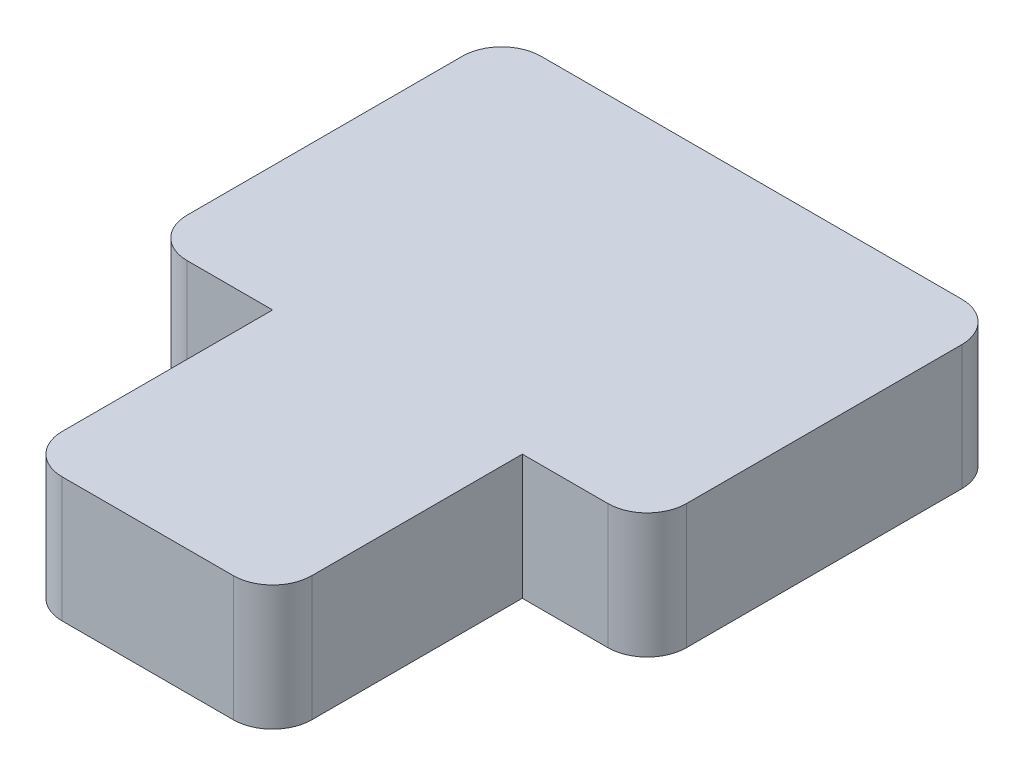
ISO-10303-21;
HEADER;
FILE_DESCRIPTION(('STEP AP214'),'2;1');
FILE_NAME('part.step','',(''),(''),'','','');
FILE_SCHEMA(('AUTOMOTIVE_DESIGN { 1 0 10303 214 1 1 1 1 }'));
ENDSEC;
DATA;
#1=APPLICATION_CONTEXT('core data for automotive mechanical design processes');
#2=APPLICATION_PROTOCOL_DEFINITION('international standard','automotive_design',2000,#1);
#3=PRODUCT_CONTEXT('',#1,'mechanical');
#4=PRODUCT('Part','Part','',(#3));
#5=PRODUCT_RELATED_PRODUCT_CATEGORY('part','',(#4));
#6=PRODUCT_DEFINITION_FORMATION('','',#4);
#7=PRODUCT_DEFINITION_CONTEXT('part definition',#1,'design');
#8=PRODUCT_DEFINITION('design','',#6,#7);
#9=PRODUCT_DEFINITION_SHAPE('','',#8);
#10=(LENGTH_UNIT() NAMED_UNIT(*) SI_UNIT(.MILLI.,.METRE.));
#11=(NAMED_UNIT(*) PLANE_ANGLE_UNIT() SI_UNIT($,.RADIAN.));
#12=(NAMED_UNIT(*) SI_UNIT($,.STERADIAN.) SOLID_ANGLE_UNIT());
#13=UNCERTAINTY_MEASURE_WITH_UNIT(LENGTH_MEASURE(1.E-05),#10,'distance_accuracy_value','');
#14=(GEOMETRIC_REPRESENTATION_CONTEXT(3) GLOBAL_UNCERTAINTY_ASSIGNED_CONTEXT((#13)) GLOBAL_UNIT_ASSIGNED_CONTEXT((#10,
#11,#12)) REPRESENTATION_CONTEXT('',''));
#15=CARTESIAN_POINT('',(0.,0.,0.));
#16=DIRECTION('',(0.,0.,1.));
#17=DIRECTION('',(1.,0.,0.));
#18=AXIS2_PLACEMENT_3D('',#15,#16,#17);
#19=CARTESIAN_POINT('',(0.,3.175,0.));
#20=DIRECTION('',(1.,0.,0.));
#21=DIRECTION('',(0.,0.,-1.));
#22=AXIS2_PLACEMENT_3D('',#19,#20,#21);
#23=PLANE('',#22);
#24=DIRECTION('',(0.,0.,1.));
#25=VECTOR('',#24,1.);
#26=CARTESIAN_POINT('',(0.,0.,0.));
#27=LINE('',#26,#25);
#28=CARTESIAN_POINT('',(0.,0.,-6.35));
#29=VERTEX_POINT('',#28);
#30=CARTESIAN_POINT('',(0.,0.,-1.));
#31=VERTEX_POINT('',#30);
#32=EDGE_CURVE('E175',#29,#31,#27,.T.);
#33=ORIENTED_EDGE('',*,*,#32,.T.);
#34=DIRECTION('',(0.,-1.,0.));
#35=VECTOR('',#34,1.);
#36=CARTESIAN_POINT('',(0.,3.175,-1.));
#37=LINE('',#36,#35);
#38=CARTESIAN_POINT('',(0.,3.175,-1.));
#39=VERTEX_POINT('',#38);
#40=EDGE_CURVE('E41',#31,#39,#37,.F.);
#41=ORIENTED_EDGE('',*,*,#40,.T.);
#42=DIRECTION('',(0.,0.,1.));
#43=VECTOR('',#42,1.);
#44=CARTESIAN_POINT('',(0.,3.175,0.));
#45=LINE('',#44,#43);
#46=CARTESIAN_POINT('',(0.,3.175,-6.35));
#47=VERTEX_POINT('',#46);
#48=EDGE_CURVE('E194',#47,#39,#45,.T.);
#49=ORIENTED_EDGE('',*,*,#48,.F.);
#50=DIRECTION('',(0.,-1.,0.));
#51=VECTOR('',#50,1.);
#52=CARTESIAN_POINT('',(0.,3.175,-6.35));
#53=LINE('',#52,#51);
#54=EDGE_CURVE('E159',#47,#29,#53,.T.);
#55=ORIENTED_EDGE('',*,*,#54,.T.);
#56=EDGE_LOOP('',(#33,#41,#49,#55));
#57=FACE_BOUND('',#56,.T.);
#58=ADVANCED_FACE('F33',(#57),#23,.F.);
#59=CARTESIAN_POINT('',(0.,3.175,0.));
#60=DIRECTION('',(0.,0.,-1.));
#61=DIRECTION('',(-1.,0.,0.));
#62=AXIS2_PLACEMENT_3D('',#59,#60,#61);
#63=PLANE('',#62);
#64=DIRECTION('',(1.,0.,0.));
#65=VECTOR('',#64,1.);
#66=CARTESIAN_POINT('',(0.,3.175,0.));
#67=LINE('',#66,#65);
#68=CARTESIAN_POINT('',(0.999999999999999,3.175,0.));
#69=VERTEX_POINT('',#68);
#70=CARTESIAN_POINT('',(5.35,3.175,0.));
#71=VERTEX_POINT('',#70);
#72=EDGE_CURVE('E148',#69,#71,#67,.T.);
#73=ORIENTED_EDGE('',*,*,#72,.F.);
#74=DIRECTION('',(0.,-1.,0.));
#75=VECTOR('',#74,1.);
#76=CARTESIAN_POINT('',(1.,3.175,0.));
#77=LINE('',#76,#75);
#78=CARTESIAN_POINT('',(0.999999999999999,0.,0.));
#79=VERTEX_POINT('',#78);
#80=EDGE_CURVE('E238',#69,#79,#77,.T.);
#81=ORIENTED_EDGE('',*,*,#80,.T.);
#82=DIRECTION('',(1.,0.,0.));
#83=VECTOR('',#82,1.);
#84=CARTESIAN_POINT('',(0.,0.,0.));
#85=LINE('',#84,#83);
#86=CARTESIAN_POINT('',(5.35,0.,0.));
#87=VERTEX_POINT('',#86);
#88=EDGE_CURVE('E178',#79,#87,#85,.T.);
#89=ORIENTED_EDGE('',*,*,#88,.T.);
#90=DIRECTION('',(0.,-1.,0.));
#91=VECTOR('',#90,1.);
#92=CARTESIAN_POINT('',(5.35,3.175,0.));
#93=LINE('',#92,#91);
#94=EDGE_CURVE('E236',#87,#71,#93,.F.);
#95=ORIENTED_EDGE('',*,*,#94,.T.);
#96=EDGE_LOOP('',(#73,#81,#89,#95));
#97=FACE_BOUND('',#96,.T.);
#98=ADVANCED_FACE('F254',(#97),#63,.F.);
#99=CARTESIAN_POINT('',(6.35,3.175,0.));
#100=DIRECTION('',(-1.,0.,0.));
#101=DIRECTION('',(0.,0.,1.));
#102=AXIS2_PLACEMENT_3D('',#99,#100,#101);
#103=PLANE('',#102);
#104=DIRECTION('',(0.,0.,-1.));
#105=VECTOR('',#104,1.);
#106=CARTESIAN_POINT('',(6.35,3.175,0.));
#107=LINE('',#106,#105);
#108=CARTESIAN_POINT('',(6.35,3.175,-1.));
#109=VERTEX_POINT('',#108);
#110=CARTESIAN_POINT('',(6.35,3.175,-6.35));
#111=VERTEX_POINT('',#110);
#112=EDGE_CURVE('E136',#109,#111,#107,.T.);
#113=ORIENTED_EDGE('',*,*,#112,.F.);
#114=DIRECTION('',(0.,-1.,0.));
#115=VECTOR('',#114,1.);
#116=CARTESIAN_POINT('',(6.35,3.175,-1.));
#117=LINE('',#116,#115);
#118=CARTESIAN_POINT('',(6.35,0.,-1.));
#119=VERTEX_POINT('',#118);
#120=EDGE_CURVE('E11',#109,#119,#117,.T.);
#121=ORIENTED_EDGE('',*,*,#120,.T.);
#122=DIRECTION('',(0.,0.,-1.));
#123=VECTOR('',#122,1.);
#124=CARTESIAN_POINT('',(6.35,0.,0.));
#125=LINE('',#124,#123);
#126=CARTESIAN_POINT('',(6.35,0.,-6.35));
#127=VERTEX_POINT('',#126);
#128=EDGE_CURVE('E154',#119,#127,#125,.T.);
#129=ORIENTED_EDGE('',*,*,#128,.T.);
#130=DIRECTION('',(0.,-1.,0.));
#131=VECTOR('',#130,1.);
#132=CARTESIAN_POINT('',(6.35,3.175,-6.35));
#133=LINE('',#132,#131);
#134=EDGE_CURVE('E151',#111,#127,#133,.T.);
#135=ORIENTED_EDGE('',*,*,#134,.F.);
#136=EDGE_LOOP('',(#113,#121,#129,#135));
#137=FACE_BOUND('',#136,.T.);
#138=ADVANCED_FACE('F152',(#137),#103,.F.);
#139=CARTESIAN_POINT('',(6.35,3.175,-6.35));
#140=DIRECTION('',(0.,0.,-1.));
#141=DIRECTION('',(-1.,0.,0.));
#142=AXIS2_PLACEMENT_3D('',#139,#140,#141);
#143=PLANE('',#142);
#144=DIRECTION('',(1.,0.,0.));
#145=VECTOR('',#144,1.);
#146=CARTESIAN_POINT('',(6.35,0.,-6.35));
#147=LINE('',#146,#145);
#148=CARTESIAN_POINT('',(8.525,0.,-6.35));
#149=VERTEX_POINT('',#148);
#150=EDGE_CURVE('E182',#127,#149,#147,.T.);
#151=ORIENTED_EDGE('',*,*,#150,.T.);
#152=DIRECTION('',(0.,-1.,0.));
#153=VECTOR('',#152,1.);
#154=CARTESIAN_POINT('',(8.525,3.175,-6.35));
#155=LINE('',#154,#153);
#156=CARTESIAN_POINT('',(8.525,3.175,-6.35));
#157=VERTEX_POINT('',#156);
#158=EDGE_CURVE('E163',#149,#157,#155,.F.);
#159=ORIENTED_EDGE('',*,*,#158,.T.);
#160=DIRECTION('',(1.,0.,0.));
#161=VECTOR('',#160,1.);
#162=CARTESIAN_POINT('',(6.35,3.175,-6.35));
#163=LINE('',#162,#161);
#164=EDGE_CURVE('E141',#111,#157,#163,.T.);
#165=ORIENTED_EDGE('',*,*,#164,.F.);
#166=ORIENTED_EDGE('',*,*,#134,.T.);
#167=EDGE_LOOP('',(#151,#159,#165,#166));
#168=FACE_BOUND('',#167,.T.);
#169=ADVANCED_FACE('F161',(#168),#143,.F.);
#170=CARTESIAN_POINT('',(9.525,3.175,-15.35));
#171=DIRECTION('',(-1.,0.,0.));
#172=DIRECTION('',(0.,0.,1.));
#173=AXIS2_PLACEMENT_3D('',#170,#171,#172);
#174=PLANE('',#173);
#175=DIRECTION('',(0.,0.,-1.));
#176=VECTOR('',#175,1.);
#177=CARTESIAN_POINT('',(9.525,3.175,-15.35));
#178=LINE('',#177,#176);
#179=CARTESIAN_POINT('',(9.525,3.175,-7.35));
#180=VERTEX_POINT('',#179);
#181=CARTESIAN_POINT('',(9.525,3.175,-14.35));
#182=VERTEX_POINT('',#181);
#183=EDGE_CURVE('E164',#180,#182,#178,.T.);
#184=ORIENTED_EDGE('',*,*,#183,.F.);
#185=DIRECTION('',(0.,-1.,0.));
#186=VECTOR('',#185,1.);
#187=CARTESIAN_POINT('',(9.525,3.175,-7.35));
#188=LINE('',#187,#186);
#189=CARTESIAN_POINT('',(9.525,0.,-7.35));
#190=VERTEX_POINT('',#189);
#191=EDGE_CURVE('E232',#180,#190,#188,.T.);
#192=ORIENTED_EDGE('',*,*,#191,.T.);
#193=DIRECTION('',(0.,0.,-1.));
#194=VECTOR('',#193,1.);
#195=CARTESIAN_POINT('',(9.525,0.,-15.35));
#196=LINE('',#195,#194);
#197=CARTESIAN_POINT('',(9.525,0.,-14.35));
#198=VERTEX_POINT('',#197);
#199=EDGE_CURVE('E184',#190,#198,#196,.T.);
#200=ORIENTED_EDGE('',*,*,#199,.T.);
#201=DIRECTION('',(0.,-1.,0.));
#202=VECTOR('',#201,1.);
#203=CARTESIAN_POINT('',(9.525,3.175,-14.35));
#204=LINE('',#203,#202);
#205=EDGE_CURVE('E56',#198,#182,#204,.F.);
#206=ORIENTED_EDGE('',*,*,#205,.T.);
#207=EDGE_LOOP('',(#184,#192,#200,#206));
#208=FACE_BOUND('',#207,.T.);
#209=ADVANCED_FACE('F307',(#208),#174,.F.);
#210=CARTESIAN_POINT('',(-3.175,3.175,-15.35));
#211=DIRECTION('',(0.,0.,1.));
#212=DIRECTION('',(1.,0.,0.));
#213=AXIS2_PLACEMENT_3D('',#210,#211,#212);
#214=PLANE('',#213);
#215=DIRECTION('',(-1.,0.,0.));
#216=VECTOR('',#215,1.);
#217=CARTESIAN_POINT('',(-3.175,0.,-15.35));
#218=LINE('',#217,#216);
#219=CARTESIAN_POINT('',(8.525,0.,-15.35));
#220=VERTEX_POINT('',#219);
#221=CARTESIAN_POINT('',(-2.175,0.,-15.35));
#222=VERTEX_POINT('',#221);
#223=EDGE_CURVE('E186',#220,#222,#218,.T.);
#224=ORIENTED_EDGE('',*,*,#223,.T.);
#225=DIRECTION('',(0.,-1.,0.));
#226=VECTOR('',#225,1.);
#227=CARTESIAN_POINT('',(-2.175,3.175,-15.35));
#228=LINE('',#227,#226);
#229=CARTESIAN_POINT('',(-2.175,3.175,-15.35));
#230=VERTEX_POINT('',#229);
#231=EDGE_CURVE('E216',#222,#230,#228,.F.);
#232=ORIENTED_EDGE('',*,*,#231,.T.);
#233=DIRECTION('',(-1.,0.,0.));
#234=VECTOR('',#233,1.);
#235=CARTESIAN_POINT('',(-3.175,3.175,-15.35));
#236=LINE('',#235,#234);
#237=CARTESIAN_POINT('',(8.525,3.175,-15.35));
#238=VERTEX_POINT('',#237);
#239=EDGE_CURVE('E166',#238,#230,#236,.T.);
#240=ORIENTED_EDGE('',*,*,#239,.F.);
#241=DIRECTION('',(0.,-1.,0.));
#242=VECTOR('',#241,1.);
#243=CARTESIAN_POINT('',(8.525,3.175,-15.35));
#244=LINE('',#243,#242);
#245=EDGE_CURVE('E213',#238,#220,#244,.T.);
#246=ORIENTED_EDGE('',*,*,#245,.T.);
#247=EDGE_LOOP('',(#224,#232,#240,#246));
#248=FACE_BOUND('',#247,.T.);
#249=ADVANCED_FACE('F294',(#248),#214,.F.);
#250=CARTESIAN_POINT('',(-3.175,3.175,-15.35));
#251=DIRECTION('',(1.,0.,0.));
#252=DIRECTION('',(0.,0.,-1.));
#253=AXIS2_PLACEMENT_3D('',#250,#251,#252);
#254=PLANE('',#253);
#255=DIRECTION('',(0.,0.,1.));
#256=VECTOR('',#255,1.);
#257=CARTESIAN_POINT('',(-3.175,3.175,-15.35));
#258=LINE('',#257,#256);
#259=CARTESIAN_POINT('',(-3.175,3.175,-14.35));
#260=VERTEX_POINT('',#259);
#261=CARTESIAN_POINT('',(-3.175,3.175,-7.35));
#262=VERTEX_POINT('',#261);
#263=EDGE_CURVE('E171',#260,#262,#258,.T.);
#264=ORIENTED_EDGE('',*,*,#263,.F.);
#265=DIRECTION('',(0.,-1.,0.));
#266=VECTOR('',#265,1.);
#267=CARTESIAN_POINT('',(-3.175,3.175,-14.35));
#268=LINE('',#267,#266);
#269=CARTESIAN_POINT('',(-3.175,0.,-14.35));
#270=VERTEX_POINT('',#269);
#271=EDGE_CURVE('E198',#260,#270,#268,.T.);
#272=ORIENTED_EDGE('',*,*,#271,.T.);
#273=DIRECTION('',(0.,0.,1.));
#274=VECTOR('',#273,1.);
#275=CARTESIAN_POINT('',(-3.175,0.,-15.35));
#276=LINE('',#275,#274);
#277=CARTESIAN_POINT('',(-3.175,0.,-7.35));
#278=VERTEX_POINT('',#277);
#279=EDGE_CURVE('E189',#270,#278,#276,.T.);
#280=ORIENTED_EDGE('',*,*,#279,.T.);
#281=DIRECTION('',(0.,-1.,0.));
#282=VECTOR('',#281,1.);
#283=CARTESIAN_POINT('',(-3.175,3.175,-7.35));
#284=LINE('',#283,#282);
#285=EDGE_CURVE('E158',#278,#262,#284,.F.);
#286=ORIENTED_EDGE('',*,*,#285,.T.);
#287=EDGE_LOOP('',(#264,#272,#280,#286));
#288=FACE_BOUND('',#287,.T.);
#289=ADVANCED_FACE('F300',(#288),#254,.F.);
#290=CARTESIAN_POINT('',(-3.175,3.175,-6.35));
#291=DIRECTION('',(0.,0.,-1.));
#292=DIRECTION('',(-1.,0.,0.));
#293=AXIS2_PLACEMENT_3D('',#290,#291,#292);
#294=PLANE('',#293);
#295=DIRECTION('',(1.,0.,0.));
#296=VECTOR('',#295,1.);
#297=CARTESIAN_POINT('',(-3.175,3.175,-6.35));
#298=LINE('',#297,#296);
#299=CARTESIAN_POINT('',(-2.175,3.175,-6.35));
#300=VERTEX_POINT('',#299);
#301=EDGE_CURVE('E173',#300,#47,#298,.T.);
#302=ORIENTED_EDGE('',*,*,#301,.F.);
#303=DIRECTION('',(0.,-1.,0.));
#304=VECTOR('',#303,1.);
#305=CARTESIAN_POINT('',(-2.175,3.175,-6.35));
#306=LINE('',#305,#304);
#307=CARTESIAN_POINT('',(-2.175,0.,-6.35));
#308=VERTEX_POINT('',#307);
#309=EDGE_CURVE('E228',#300,#308,#306,.T.);
#310=ORIENTED_EDGE('',*,*,#309,.T.);
#311=DIRECTION('',(1.,0.,0.));
#312=VECTOR('',#311,1.);
#313=CARTESIAN_POINT('',(-3.175,0.,-6.35));
#314=LINE('',#313,#312);
#315=EDGE_CURVE('E192',#308,#29,#314,.T.);
#316=ORIENTED_EDGE('',*,*,#315,.T.);
#317=ORIENTED_EDGE('',*,*,#54,.F.);
#318=EDGE_LOOP('',(#302,#310,#316,#317));
#319=FACE_BOUND('',#318,.T.);
#320=ADVANCED_FACE('F305',(#319),#294,.F.);
#321=CARTESIAN_POINT('',(0.,3.175,0.));
#322=DIRECTION('',(0.,-1.,0.));
#323=DIRECTION('',(0.,0.,-1.));
#324=AXIS2_PLACEMENT_3D('',#321,#322,#323);
#325=PLANE('',#324);
#326=ORIENTED_EDGE('',*,*,#239,.T.);
#327=CARTESIAN_POINT('',(-2.175,3.175,-14.35));
#328=DIRECTION('',(0.,-1.,0.));
#329=DIRECTION('',(0.,0.,-1.));
#330=AXIS2_PLACEMENT_3D('',#327,#328,#329);
#331=CIRCLE('',#330,1.);
#332=EDGE_CURVE('E226',#230,#260,#331,.F.);
#333=ORIENTED_EDGE('',*,*,#332,.T.);
#334=ORIENTED_EDGE('',*,*,#263,.T.);
#335=CARTESIAN_POINT('',(-2.175,3.175,-7.35));
#336=DIRECTION('',(0.,-1.,0.));
#337=DIRECTION('',(0.,0.,-1.));
#338=AXIS2_PLACEMENT_3D('',#335,#336,#337);
#339=CIRCLE('',#338,1.);
#340=EDGE_CURVE('E48',#262,#300,#339,.F.);
#341=ORIENTED_EDGE('',*,*,#340,.T.);
#342=ORIENTED_EDGE('',*,*,#301,.T.);
#343=ORIENTED_EDGE('',*,*,#48,.T.);
#344=CARTESIAN_POINT('',(1.,3.175,-1.));
#345=DIRECTION('',(0.,-1.,0.));
#346=DIRECTION('',(0.,0.,-1.));
#347=AXIS2_PLACEMENT_3D('',#344,#345,#346);
#348=CIRCLE('',#347,1.);
#349=EDGE_CURVE('E219',#39,#69,#348,.F.);
#350=ORIENTED_EDGE('',*,*,#349,.T.);
#351=ORIENTED_EDGE('',*,*,#72,.T.);
#352=CARTESIAN_POINT('',(5.35,3.175,-1.));
#353=DIRECTION('',(0.,-1.,0.));
#354=DIRECTION('',(0.,0.,-1.));
#355=AXIS2_PLACEMENT_3D('',#352,#353,#354);
#356=CIRCLE('',#355,1.);
#357=EDGE_CURVE('E145',#71,#109,#356,.F.);
#358=ORIENTED_EDGE('',*,*,#357,.T.);
#359=ORIENTED_EDGE('',*,*,#112,.T.);
#360=ORIENTED_EDGE('',*,*,#164,.T.);
#361=CARTESIAN_POINT('',(8.525,3.175,-7.35));
#362=DIRECTION('',(0.,-1.,0.));
#363=DIRECTION('',(0.,0.,-1.));
#364=AXIS2_PLACEMENT_3D('',#361,#362,#363);
#365=CIRCLE('',#364,1.);
#366=EDGE_CURVE('E223',#157,#180,#365,.F.);
#367=ORIENTED_EDGE('',*,*,#366,.T.);
#368=ORIENTED_EDGE('',*,*,#183,.T.);
#369=CARTESIAN_POINT('',(8.525,3.175,-14.35));
#370=DIRECTION('',(0.,-1.,0.));
#371=DIRECTION('',(0.,0.,-1.));
#372=AXIS2_PLACEMENT_3D('',#369,#370,#371);
#373=CIRCLE('',#372,1.);
#374=EDGE_CURVE('E221',#182,#238,#373,.F.);
#375=ORIENTED_EDGE('',*,*,#374,.T.);
#376=EDGE_LOOP('',(#326,#333,#334,#341,#342,#343,#350,#351,#358,#359,#360,#367,#368,#375));
#377=FACE_BOUND('',#376,.T.);
#378=ADVANCED_FACE('F139',(#377),#325,.F.);
#379=CARTESIAN_POINT('',(0.,0.,0.));
#380=DIRECTION('',(0.,-1.,0.));
#381=DIRECTION('',(0.,0.,-1.));
#382=AXIS2_PLACEMENT_3D('',#379,#380,#381);
#383=PLANE('',#382);
#384=ORIENTED_EDGE('',*,*,#279,.F.);
#385=CARTESIAN_POINT('',(-2.175,0.,-14.35));
#386=DIRECTION('',(0.,-1.,0.));
#387=DIRECTION('',(0.,0.,-1.));
#388=AXIS2_PLACEMENT_3D('',#385,#386,#387);
#389=CIRCLE('',#388,1.);
#390=EDGE_CURVE('E211',#270,#222,#389,.T.);
#391=ORIENTED_EDGE('',*,*,#390,.T.);
#392=ORIENTED_EDGE('',*,*,#223,.F.);
#393=CARTESIAN_POINT('',(8.525,0.,-14.35));
#394=DIRECTION('',(0.,-1.,0.));
#395=DIRECTION('',(0.,0.,-1.));
#396=AXIS2_PLACEMENT_3D('',#393,#394,#395);
#397=CIRCLE('',#396,1.);
#398=EDGE_CURVE('E205',#220,#198,#397,.T.);
#399=ORIENTED_EDGE('',*,*,#398,.T.);
#400=ORIENTED_EDGE('',*,*,#199,.F.);
#401=CARTESIAN_POINT('',(8.525,0.,-7.35));
#402=DIRECTION('',(0.,-1.,0.));
#403=DIRECTION('',(0.,0.,-1.));
#404=AXIS2_PLACEMENT_3D('',#401,#402,#403);
#405=CIRCLE('',#404,1.);
#406=EDGE_CURVE('E207',#190,#149,#405,.T.);
#407=ORIENTED_EDGE('',*,*,#406,.T.);
#408=ORIENTED_EDGE('',*,*,#150,.F.);
#409=ORIENTED_EDGE('',*,*,#128,.F.);
#410=CARTESIAN_POINT('',(5.35,0.,-1.));
#411=DIRECTION('',(0.,-1.,0.));
#412=DIRECTION('',(0.,0.,-1.));
#413=AXIS2_PLACEMENT_3D('',#410,#411,#412);
#414=CIRCLE('',#413,1.);
#415=EDGE_CURVE('E201',#119,#87,#414,.T.);
#416=ORIENTED_EDGE('',*,*,#415,.T.);
#417=ORIENTED_EDGE('',*,*,#88,.F.);
#418=CARTESIAN_POINT('',(1.,0.,-1.));
#419=DIRECTION('',(0.,-1.,0.));
#420=DIRECTION('',(0.,0.,-1.));
#421=AXIS2_PLACEMENT_3D('',#418,#419,#420);
#422=CIRCLE('',#421,1.);
#423=EDGE_CURVE('E203',#79,#31,#422,.T.);
#424=ORIENTED_EDGE('',*,*,#423,.T.);
#425=ORIENTED_EDGE('',*,*,#32,.F.);
#426=ORIENTED_EDGE('',*,*,#315,.F.);
#427=CARTESIAN_POINT('',(-2.175,0.,-7.35));
#428=DIRECTION('',(0.,-1.,0.));
#429=DIRECTION('',(0.,0.,-1.));
#430=AXIS2_PLACEMENT_3D('',#427,#428,#429);
#431=CIRCLE('',#430,1.);
#432=EDGE_CURVE('E209',#308,#278,#431,.T.);
#433=ORIENTED_EDGE('',*,*,#432,.T.);
#434=EDGE_LOOP('',(#384,#391,#392,#399,#400,#407,#408,#409,#416,#417,#424,#425,#426,#433));
#435=FACE_BOUND('',#434,.T.);
#436=ADVANCED_FACE('F258',(#435),#383,.T.);
#437=CARTESIAN_POINT('',(-2.175,3.175,-14.35));
#438=DIRECTION('',(0.,-1.,0.));
#439=DIRECTION('',(0.,0.,-1.));
#440=AXIS2_PLACEMENT_3D('',#437,#438,#439);
#441=CYLINDRICAL_SURFACE('',#440,1.);
#442=ORIENTED_EDGE('',*,*,#332,.F.);
#443=ORIENTED_EDGE('',*,*,#231,.F.);
#444=ORIENTED_EDGE('',*,*,#390,.F.);
#445=ORIENTED_EDGE('',*,*,#271,.F.);
#446=EDGE_LOOP('',(#442,#443,#444,#445));
#447=FACE_BOUND('',#446,.T.);
#448=ADVANCED_FACE('F273',(#447),#441,.T.);
#449=CARTESIAN_POINT('',(-2.175,3.175,-7.35));
#450=DIRECTION('',(0.,-1.,0.));
#451=DIRECTION('',(0.,0.,-1.));
#452=AXIS2_PLACEMENT_3D('',#449,#450,#451);
#453=CYLINDRICAL_SURFACE('',#452,1.);
#454=ORIENTED_EDGE('',*,*,#340,.F.);
#455=ORIENTED_EDGE('',*,*,#285,.F.);
#456=ORIENTED_EDGE('',*,*,#432,.F.);
#457=ORIENTED_EDGE('',*,*,#309,.F.);
#458=EDGE_LOOP('',(#454,#455,#456,#457));
#459=FACE_BOUND('',#458,.T.);
#460=ADVANCED_FACE('F276',(#459),#453,.T.);
#461=CARTESIAN_POINT('',(8.525,3.175,-7.35));
#462=DIRECTION('',(0.,-1.,0.));
#463=DIRECTION('',(0.,0.,-1.));
#464=AXIS2_PLACEMENT_3D('',#461,#462,#463);
#465=CYLINDRICAL_SURFACE('',#464,1.);
#466=ORIENTED_EDGE('',*,*,#366,.F.);
#467=ORIENTED_EDGE('',*,*,#158,.F.);
#468=ORIENTED_EDGE('',*,*,#406,.F.);
#469=ORIENTED_EDGE('',*,*,#191,.F.);
#470=EDGE_LOOP('',(#466,#467,#468,#469));
#471=FACE_BOUND('',#470,.T.);
#472=ADVANCED_FACE('F280',(#471),#465,.T.);
#473=CARTESIAN_POINT('',(8.525,3.175,-14.35));
#474=DIRECTION('',(0.,-1.,0.));
#475=DIRECTION('',(0.,0.,-1.));
#476=AXIS2_PLACEMENT_3D('',#473,#474,#475);
#477=CYLINDRICAL_SURFACE('',#476,1.);
#478=ORIENTED_EDGE('',*,*,#374,.F.);
#479=ORIENTED_EDGE('',*,*,#205,.F.);
#480=ORIENTED_EDGE('',*,*,#398,.F.);
#481=ORIENTED_EDGE('',*,*,#245,.F.);
#482=EDGE_LOOP('',(#478,#479,#480,#481));
#483=FACE_BOUND('',#482,.T.);
#484=ADVANCED_FACE('F264',(#483),#477,.T.);
#485=CARTESIAN_POINT('',(1.,3.175,-1.));
#486=DIRECTION('',(0.,-1.,0.));
#487=DIRECTION('',(0.,0.,-1.));
#488=AXIS2_PLACEMENT_3D('',#485,#486,#487);
#489=CYLINDRICAL_SURFACE('',#488,1.);
#490=ORIENTED_EDGE('',*,*,#349,.F.);
#491=ORIENTED_EDGE('',*,*,#40,.F.);
#492=ORIENTED_EDGE('',*,*,#423,.F.);
#493=ORIENTED_EDGE('',*,*,#80,.F.);
#494=EDGE_LOOP('',(#490,#491,#492,#493));
#495=FACE_BOUND('',#494,.T.);
#496=ADVANCED_FACE('F251',(#495),#489,.T.);
#497=CARTESIAN_POINT('',(5.35,3.175,-1.));
#498=DIRECTION('',(0.,-1.,0.));
#499=DIRECTION('',(0.,0.,-1.));
#500=AXIS2_PLACEMENT_3D('',#497,#498,#499);
#501=CYLINDRICAL_SURFACE('',#500,1.);
#502=ORIENTED_EDGE('',*,*,#357,.F.);
#503=ORIENTED_EDGE('',*,*,#94,.F.);
#504=ORIENTED_EDGE('',*,*,#415,.F.);
#505=ORIENTED_EDGE('',*,*,#120,.F.);
#506=EDGE_LOOP('',(#502,#503,#504,#505));
#507=FACE_BOUND('',#506,.T.);
#508=ADVANCED_FACE('F35',(#507),#501,.T.);
#509=CLOSED_SHELL('',(#58,#98,#138,#169,#209,#249,#289,#320,#378,#436,#448,#460,#472,#484,#496,#508));
#510=MANIFOLD_SOLID_BREP('B2',#509);
#511=ADVANCED_BREP_SHAPE_REPRESENTATION('',(#18,#510),#14);
#512=SHAPE_DEFINITION_REPRESENTATION(#9,#511);
ENDSEC;
END-ISO-10303-21;
